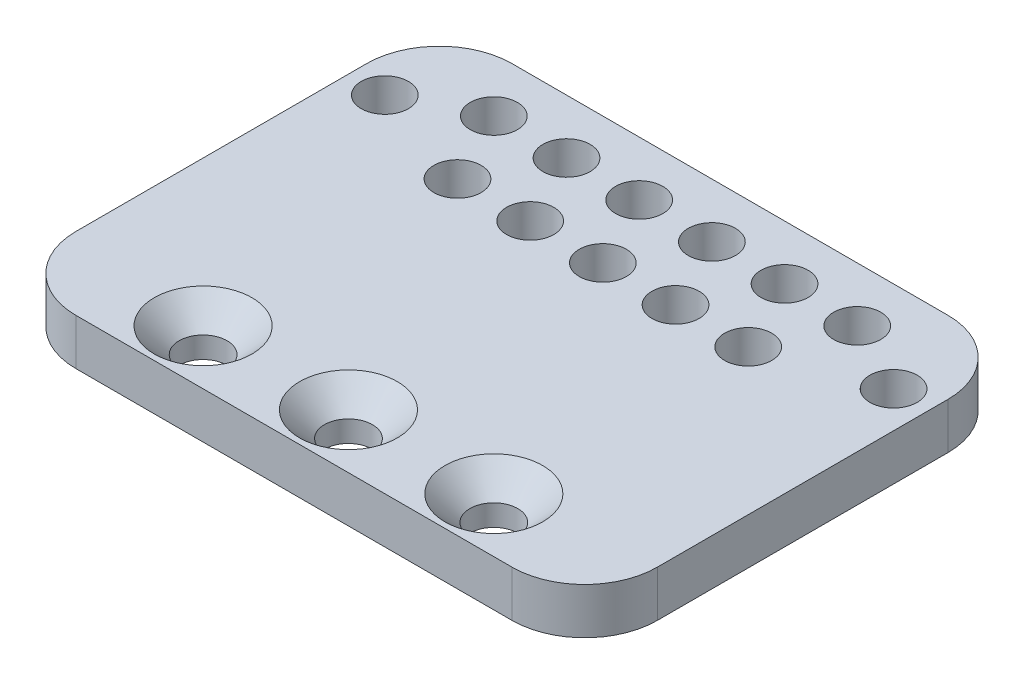
ISO-10303-21;
HEADER;
FILE_DESCRIPTION(('STEP AP214'),'2;1');
FILE_NAME('part.step','',(''),(''),'','','');
FILE_SCHEMA(('AUTOMOTIVE_DESIGN { 1 0 10303 214 1 1 1 1 }'));
ENDSEC;
DATA;
#1=APPLICATION_CONTEXT('core data for automotive mechanical design processes');
#2=APPLICATION_PROTOCOL_DEFINITION('international standard','automotive_design',2000,#1);
#3=PRODUCT_CONTEXT('',#1,'mechanical');
#4=PRODUCT('Part','Part','',(#3));
#5=PRODUCT_RELATED_PRODUCT_CATEGORY('part','',(#4));
#6=PRODUCT_DEFINITION_FORMATION('','',#4);
#7=PRODUCT_DEFINITION_CONTEXT('part definition',#1,'design');
#8=PRODUCT_DEFINITION('design','',#6,#7);
#9=PRODUCT_DEFINITION_SHAPE('','',#8);
#10=(LENGTH_UNIT() NAMED_UNIT(*) SI_UNIT(.MILLI.,.METRE.));
#11=(NAMED_UNIT(*) PLANE_ANGLE_UNIT() SI_UNIT($,.RADIAN.));
#12=(NAMED_UNIT(*) SI_UNIT($,.STERADIAN.) SOLID_ANGLE_UNIT());
#13=UNCERTAINTY_MEASURE_WITH_UNIT(LENGTH_MEASURE(1.E-05),#10,'distance_accuracy_value','');
#14=(GEOMETRIC_REPRESENTATION_CONTEXT(3) GLOBAL_UNCERTAINTY_ASSIGNED_CONTEXT((#13)) GLOBAL_UNIT_ASSIGNED_CONTEXT((#10,
#11,#12)) REPRESENTATION_CONTEXT('',''));
#15=CARTESIAN_POINT('',(0.,0.,0.));
#16=DIRECTION('',(0.,0.,1.));
#17=DIRECTION('',(1.,0.,0.));
#18=AXIS2_PLACEMENT_3D('',#15,#16,#17);
#19=CARTESIAN_POINT('',(0.,6.35,0.));
#20=DIRECTION('',(0.,0.,-1.));
#21=DIRECTION('',(-1.,0.,0.));
#22=AXIS2_PLACEMENT_3D('',#19,#20,#21);
#23=PLANE('',#22);
#24=DIRECTION('',(1.,0.,0.));
#25=VECTOR('',#24,1.);
#26=CARTESIAN_POINT('',(0.,0.,0.));
#27=LINE('',#26,#25);
#28=CARTESIAN_POINT('',(10.,0.,0.));
#29=VERTEX_POINT('',#28);
#30=CARTESIAN_POINT('',(70.,0.,0.));
#31=VERTEX_POINT('',#30);
#32=EDGE_CURVE('E111',#29,#31,#27,.T.);
#33=ORIENTED_EDGE('',*,*,#32,.T.);
#34=DIRECTION('',(0.,-1.,0.));
#35=VECTOR('',#34,1.);
#36=CARTESIAN_POINT('',(70.,6.35,0.));
#37=LINE('',#36,#35);
#38=CARTESIAN_POINT('',(70.,6.35,0.));
#39=VERTEX_POINT('',#38);
#40=EDGE_CURVE('E11',#31,#39,#37,.F.);
#41=ORIENTED_EDGE('',*,*,#40,.T.);
#42=DIRECTION('',(1.,0.,0.));
#43=VECTOR('',#42,1.);
#44=CARTESIAN_POINT('',(0.,6.35,0.));
#45=LINE('',#44,#43);
#46=CARTESIAN_POINT('',(10.,6.35,0.));
#47=VERTEX_POINT('',#46);
#48=EDGE_CURVE('E177',#47,#39,#45,.T.);
#49=ORIENTED_EDGE('',*,*,#48,.F.);
#50=DIRECTION('',(0.,-1.,0.));
#51=VECTOR('',#50,1.);
#52=CARTESIAN_POINT('',(10.,0.,0.));
#53=LINE('',#52,#51);
#54=EDGE_CURVE('E48',#47,#29,#53,.T.);
#55=ORIENTED_EDGE('',*,*,#54,.T.);
#56=EDGE_LOOP('',(#33,#41,#49,#55));
#57=FACE_BOUND('',#56,.T.);
#58=ADVANCED_FACE('F39',(#57),#23,.F.);
#59=CARTESIAN_POINT('',(80.,6.35,0.));
#60=DIRECTION('',(-1.,0.,0.));
#61=DIRECTION('',(0.,0.,1.));
#62=AXIS2_PLACEMENT_3D('',#59,#60,#61);
#63=PLANE('',#62);
#64=DIRECTION('',(0.,0.,-1.));
#65=VECTOR('',#64,1.);
#66=CARTESIAN_POINT('',(80.,0.,0.));
#67=LINE('',#66,#65);
#68=CARTESIAN_POINT('',(80.,0.,-10.));
#69=VERTEX_POINT('',#68);
#70=CARTESIAN_POINT('',(80.,0.,-50.));
#71=VERTEX_POINT('',#70);
#72=EDGE_CURVE('E248',#69,#71,#67,.T.);
#73=ORIENTED_EDGE('',*,*,#72,.T.);
#74=DIRECTION('',(0.,-1.,0.));
#75=VECTOR('',#74,1.);
#76=CARTESIAN_POINT('',(80.,6.35,-50.));
#77=LINE('',#76,#75);
#78=CARTESIAN_POINT('',(80.,6.35,-50.));
#79=VERTEX_POINT('',#78);
#80=EDGE_CURVE('E55',#71,#79,#77,.F.);
#81=ORIENTED_EDGE('',*,*,#80,.T.);
#82=DIRECTION('',(0.,0.,-1.));
#83=VECTOR('',#82,1.);
#84=CARTESIAN_POINT('',(80.,6.35,0.));
#85=LINE('',#84,#83);
#86=CARTESIAN_POINT('',(80.,6.35,-10.));
#87=VERTEX_POINT('',#86);
#88=EDGE_CURVE('E179',#87,#79,#85,.T.);
#89=ORIENTED_EDGE('',*,*,#88,.F.);
#90=DIRECTION('',(0.,-1.,0.));
#91=VECTOR('',#90,1.);
#92=CARTESIAN_POINT('',(80.,6.35,-10.));
#93=LINE('',#92,#91);
#94=EDGE_CURVE('E168',#87,#69,#93,.T.);
#95=ORIENTED_EDGE('',*,*,#94,.T.);
#96=EDGE_LOOP('',(#73,#81,#89,#95));
#97=FACE_BOUND('',#96,.T.);
#98=ADVANCED_FACE('F276',(#97),#63,.F.);
#99=CARTESIAN_POINT('',(0.,6.35,-60.));
#100=DIRECTION('',(0.,0.,-1.));
#101=DIRECTION('',(-1.,0.,0.));
#102=AXIS2_PLACEMENT_3D('',#99,#100,#101);
#103=PLANE('',#102);
#104=DIRECTION('',(1.,0.,0.));
#105=VECTOR('',#104,1.);
#106=CARTESIAN_POINT('',(0.,0.,-60.));
#107=LINE('',#106,#105);
#108=CARTESIAN_POINT('',(10.,0.,-60.));
#109=VERTEX_POINT('',#108);
#110=CARTESIAN_POINT('',(70.,0.,-60.));
#111=VERTEX_POINT('',#110);
#112=EDGE_CURVE('E129',#109,#111,#107,.T.);
#113=ORIENTED_EDGE('',*,*,#112,.F.);
#114=DIRECTION('',(0.,-1.,0.));
#115=VECTOR('',#114,1.);
#116=CARTESIAN_POINT('',(10.,6.35,-60.));
#117=LINE('',#116,#115);
#118=CARTESIAN_POINT('',(10.,6.35,-60.));
#119=VERTEX_POINT('',#118);
#120=EDGE_CURVE('E155',#109,#119,#117,.F.);
#121=ORIENTED_EDGE('',*,*,#120,.T.);
#122=DIRECTION('',(1.,0.,0.));
#123=VECTOR('',#122,1.);
#124=CARTESIAN_POINT('',(0.,6.35,-60.));
#125=LINE('',#124,#123);
#126=CARTESIAN_POINT('',(70.,6.35,-60.));
#127=VERTEX_POINT('',#126);
#128=EDGE_CURVE('E139',#119,#127,#125,.T.);
#129=ORIENTED_EDGE('',*,*,#128,.T.);
#130=DIRECTION('',(0.,-1.,0.));
#131=VECTOR('',#130,1.);
#132=CARTESIAN_POINT('',(70.,0.,-60.));
#133=LINE('',#132,#131);
#134=EDGE_CURVE('E151',#127,#111,#133,.T.);
#135=ORIENTED_EDGE('',*,*,#134,.T.);
#136=EDGE_LOOP('',(#113,#121,#129,#135));
#137=FACE_BOUND('',#136,.T.);
#138=ADVANCED_FACE('F256',(#137),#103,.T.);
#139=CARTESIAN_POINT('',(35.,6.35,-52.5));
#140=DIRECTION('',(0.,-1.,0.));
#141=DIRECTION('',(0.,0.,-1.));
#142=AXIS2_PLACEMENT_3D('',#139,#140,#141);
#143=CYLINDRICAL_SURFACE('',#142,3.25);
#144=CARTESIAN_POINT('',(35.,6.35,-52.5));
#145=DIRECTION('',(0.,1.,0.));
#146=DIRECTION('',(0.,0.,1.));
#147=AXIS2_PLACEMENT_3D('',#144,#145,#146);
#148=CIRCLE('',#147,3.25);
#149=CARTESIAN_POINT('',(35.,6.35,-49.25));
#150=VERTEX_POINT('',#149);
#151=EDGE_CURVE('E180',#150,#150,#148,.T.);
#152=ORIENTED_EDGE('',*,*,#151,.T.);
#153=EDGE_LOOP('',(#152));
#154=FACE_BOUND('',#153,.T.);
#155=CARTESIAN_POINT('',(35.,0.,-52.5));
#156=DIRECTION('',(0.,1.,0.));
#157=DIRECTION('',(0.,0.,1.));
#158=AXIS2_PLACEMENT_3D('',#155,#156,#157);
#159=CIRCLE('',#158,3.25);
#160=CARTESIAN_POINT('',(35.,0.,-49.25));
#161=VERTEX_POINT('',#160);
#162=EDGE_CURVE('E242',#161,#161,#159,.T.);
#163=ORIENTED_EDGE('',*,*,#162,.F.);
#164=EDGE_LOOP('',(#163));
#165=FACE_BOUND('',#164,.T.);
#166=ADVANCED_FACE('F284',(#154,#165),#143,.F.);
#167=CARTESIAN_POINT('',(45.,6.35,-52.5));
#168=DIRECTION('',(0.,-1.,0.));
#169=DIRECTION('',(0.,0.,-1.));
#170=AXIS2_PLACEMENT_3D('',#167,#168,#169);
#171=CYLINDRICAL_SURFACE('',#170,3.25);
#172=CARTESIAN_POINT('',(45.,6.35,-52.5));
#173=DIRECTION('',(0.,1.,0.));
#174=DIRECTION('',(0.,0.,1.));
#175=AXIS2_PLACEMENT_3D('',#172,#173,#174);
#176=CIRCLE('',#175,3.25);
#177=CARTESIAN_POINT('',(45.,6.35,-49.25));
#178=VERTEX_POINT('',#177);
#179=EDGE_CURVE('E186',#178,#178,#176,.T.);
#180=ORIENTED_EDGE('',*,*,#179,.T.);
#181=EDGE_LOOP('',(#180));
#182=FACE_BOUND('',#181,.T.);
#183=CARTESIAN_POINT('',(45.,0.,-52.5));
#184=DIRECTION('',(0.,1.,0.));
#185=DIRECTION('',(0.,0.,1.));
#186=AXIS2_PLACEMENT_3D('',#183,#184,#185);
#187=CIRCLE('',#186,3.25);
#188=CARTESIAN_POINT('',(45.,0.,-49.25));
#189=VERTEX_POINT('',#188);
#190=EDGE_CURVE('E238',#189,#189,#187,.T.);
#191=ORIENTED_EDGE('',*,*,#190,.F.);
#192=EDGE_LOOP('',(#191));
#193=FACE_BOUND('',#192,.T.);
#194=ADVANCED_FACE('F287',(#182,#193),#171,.F.);
#195=CARTESIAN_POINT('',(25.,6.35,-52.5));
#196=DIRECTION('',(0.,-1.,0.));
#197=DIRECTION('',(0.,0.,-1.));
#198=AXIS2_PLACEMENT_3D('',#195,#196,#197);
#199=CYLINDRICAL_SURFACE('',#198,3.25);
#200=CARTESIAN_POINT('',(25.,6.35,-52.5));
#201=DIRECTION('',(0.,1.,0.));
#202=DIRECTION('',(0.,0.,1.));
#203=AXIS2_PLACEMENT_3D('',#200,#201,#202);
#204=CIRCLE('',#203,3.25);
#205=CARTESIAN_POINT('',(25.,6.35,-49.25));
#206=VERTEX_POINT('',#205);
#207=EDGE_CURVE('E655',#206,#206,#204,.T.);
#208=ORIENTED_EDGE('',*,*,#207,.T.);
#209=EDGE_LOOP('',(#208));
#210=FACE_BOUND('',#209,.T.);
#211=CARTESIAN_POINT('',(25.,0.,-52.5));
#212=DIRECTION('',(0.,1.,0.));
#213=DIRECTION('',(0.,0.,1.));
#214=AXIS2_PLACEMENT_3D('',#211,#212,#213);
#215=CIRCLE('',#214,3.25);
#216=CARTESIAN_POINT('',(25.,0.,-49.25));
#217=VERTEX_POINT('',#216);
#218=EDGE_CURVE('E234',#217,#217,#215,.T.);
#219=ORIENTED_EDGE('',*,*,#218,.F.);
#220=EDGE_LOOP('',(#219));
#221=FACE_BOUND('',#220,.T.);
#222=ADVANCED_FACE('F291',(#210,#221),#199,.F.);
#223=CARTESIAN_POINT('',(30.,6.35,-42.5));
#224=DIRECTION('',(0.,-1.,0.));
#225=DIRECTION('',(0.,0.,-1.));
#226=AXIS2_PLACEMENT_3D('',#223,#224,#225);
#227=CYLINDRICAL_SURFACE('',#226,3.25);
#228=CARTESIAN_POINT('',(30.,6.35,-42.5));
#229=DIRECTION('',(0.,1.,0.));
#230=DIRECTION('',(0.,0.,1.));
#231=AXIS2_PLACEMENT_3D('',#228,#229,#230);
#232=CIRCLE('',#231,3.25);
#233=CARTESIAN_POINT('',(30.,6.35,-39.25));
#234=VERTEX_POINT('',#233);
#235=EDGE_CURVE('E651',#234,#234,#232,.T.);
#236=ORIENTED_EDGE('',*,*,#235,.T.);
#237=EDGE_LOOP('',(#236));
#238=FACE_BOUND('',#237,.T.);
#239=CARTESIAN_POINT('',(30.,0.,-42.5));
#240=DIRECTION('',(0.,1.,0.));
#241=DIRECTION('',(0.,0.,1.));
#242=AXIS2_PLACEMENT_3D('',#239,#240,#241);
#243=CIRCLE('',#242,3.25);
#244=CARTESIAN_POINT('',(30.,0.,-39.25));
#245=VERTEX_POINT('',#244);
#246=EDGE_CURVE('E230',#245,#245,#243,.T.);
#247=ORIENTED_EDGE('',*,*,#246,.F.);
#248=EDGE_LOOP('',(#247));
#249=FACE_BOUND('',#248,.T.);
#250=ADVANCED_FACE('F295',(#238,#249),#227,.F.);
#251=CARTESIAN_POINT('',(40.,6.35,-42.5));
#252=DIRECTION('',(0.,-1.,0.));
#253=DIRECTION('',(0.,0.,-1.));
#254=AXIS2_PLACEMENT_3D('',#251,#252,#253);
#255=CYLINDRICAL_SURFACE('',#254,3.25);
#256=CARTESIAN_POINT('',(40.,6.35,-42.5));
#257=DIRECTION('',(0.,1.,0.));
#258=DIRECTION('',(0.,0.,1.));
#259=AXIS2_PLACEMENT_3D('',#256,#257,#258);
#260=CIRCLE('',#259,3.25);
#261=CARTESIAN_POINT('',(40.,6.35,-39.25));
#262=VERTEX_POINT('',#261);
#263=EDGE_CURVE('E647',#262,#262,#260,.T.);
#264=ORIENTED_EDGE('',*,*,#263,.T.);
#265=EDGE_LOOP('',(#264));
#266=FACE_BOUND('',#265,.T.);
#267=CARTESIAN_POINT('',(40.,0.,-42.5));
#268=DIRECTION('',(0.,1.,0.));
#269=DIRECTION('',(0.,0.,1.));
#270=AXIS2_PLACEMENT_3D('',#267,#268,#269);
#271=CIRCLE('',#270,3.25);
#272=CARTESIAN_POINT('',(40.,0.,-39.25));
#273=VERTEX_POINT('',#272);
#274=EDGE_CURVE('E226',#273,#273,#271,.T.);
#275=ORIENTED_EDGE('',*,*,#274,.F.);
#276=EDGE_LOOP('',(#275));
#277=FACE_BOUND('',#276,.T.);
#278=ADVANCED_FACE('F299',(#266,#277),#255,.F.);
#279=CARTESIAN_POINT('',(50.,6.35,-42.5));
#280=DIRECTION('',(0.,-1.,0.));
#281=DIRECTION('',(0.,0.,-1.));
#282=AXIS2_PLACEMENT_3D('',#279,#280,#281);
#283=CYLINDRICAL_SURFACE('',#282,3.25);
#284=CARTESIAN_POINT('',(50.,6.35,-42.5));
#285=DIRECTION('',(0.,1.,0.));
#286=DIRECTION('',(0.,0.,1.));
#287=AXIS2_PLACEMENT_3D('',#284,#285,#286);
#288=CIRCLE('',#287,3.25);
#289=CARTESIAN_POINT('',(50.,6.35,-39.25));
#290=VERTEX_POINT('',#289);
#291=EDGE_CURVE('E643',#290,#290,#288,.T.);
#292=ORIENTED_EDGE('',*,*,#291,.T.);
#293=EDGE_LOOP('',(#292));
#294=FACE_BOUND('',#293,.T.);
#295=CARTESIAN_POINT('',(50.,0.,-42.5));
#296=DIRECTION('',(0.,1.,0.));
#297=DIRECTION('',(0.,0.,1.));
#298=AXIS2_PLACEMENT_3D('',#295,#296,#297);
#299=CIRCLE('',#298,3.25);
#300=CARTESIAN_POINT('',(50.,0.,-39.25));
#301=VERTEX_POINT('',#300);
#302=EDGE_CURVE('E222',#301,#301,#299,.T.);
#303=ORIENTED_EDGE('',*,*,#302,.F.);
#304=EDGE_LOOP('',(#303));
#305=FACE_BOUND('',#304,.T.);
#306=ADVANCED_FACE('F303',(#294,#305),#283,.F.);
#307=CARTESIAN_POINT('',(20.,6.35,-42.5));
#308=DIRECTION('',(0.,-1.,0.));
#309=DIRECTION('',(0.,0.,-1.));
#310=AXIS2_PLACEMENT_3D('',#307,#308,#309);
#311=CYLINDRICAL_SURFACE('',#310,3.25);
#312=CARTESIAN_POINT('',(20.,6.35,-42.5));
#313=DIRECTION('',(0.,1.,0.));
#314=DIRECTION('',(0.,0.,1.));
#315=AXIS2_PLACEMENT_3D('',#312,#313,#314);
#316=CIRCLE('',#315,3.25);
#317=CARTESIAN_POINT('',(20.,6.35,-39.25));
#318=VERTEX_POINT('',#317);
#319=EDGE_CURVE('E639',#318,#318,#316,.T.);
#320=ORIENTED_EDGE('',*,*,#319,.T.);
#321=EDGE_LOOP('',(#320));
#322=FACE_BOUND('',#321,.T.);
#323=CARTESIAN_POINT('',(20.,0.,-42.5));
#324=DIRECTION('',(0.,1.,0.));
#325=DIRECTION('',(0.,0.,1.));
#326=AXIS2_PLACEMENT_3D('',#323,#324,#325);
#327=CIRCLE('',#326,3.25);
#328=CARTESIAN_POINT('',(20.,0.,-39.25));
#329=VERTEX_POINT('',#328);
#330=EDGE_CURVE('E218',#329,#329,#327,.T.);
#331=ORIENTED_EDGE('',*,*,#330,.F.);
#332=EDGE_LOOP('',(#331));
#333=FACE_BOUND('',#332,.T.);
#334=ADVANCED_FACE('F307',(#322,#333),#311,.F.);
#335=CARTESIAN_POINT('',(15.,6.35,-52.5));
#336=DIRECTION('',(0.,-1.,0.));
#337=DIRECTION('',(0.,0.,-1.));
#338=AXIS2_PLACEMENT_3D('',#335,#336,#337);
#339=CYLINDRICAL_SURFACE('',#338,3.25000000000001);
#340=CARTESIAN_POINT('',(15.,6.35,-52.5));
#341=DIRECTION('',(0.,1.,0.));
#342=DIRECTION('',(0.,0.,1.));
#343=AXIS2_PLACEMENT_3D('',#340,#341,#342);
#344=CIRCLE('',#343,3.25000000000001);
#345=CARTESIAN_POINT('',(15.,6.35,-49.25));
#346=VERTEX_POINT('',#345);
#347=EDGE_CURVE('E635',#346,#346,#344,.T.);
#348=ORIENTED_EDGE('',*,*,#347,.T.);
#349=EDGE_LOOP('',(#348));
#350=FACE_BOUND('',#349,.T.);
#351=CARTESIAN_POINT('',(15.,0.,-52.5));
#352=DIRECTION('',(0.,1.,0.));
#353=DIRECTION('',(0.,0.,1.));
#354=AXIS2_PLACEMENT_3D('',#351,#352,#353);
#355=CIRCLE('',#354,3.25000000000001);
#356=CARTESIAN_POINT('',(15.,0.,-49.25));
#357=VERTEX_POINT('',#356);
#358=EDGE_CURVE('E214',#357,#357,#355,.T.);
#359=ORIENTED_EDGE('',*,*,#358,.F.);
#360=EDGE_LOOP('',(#359));
#361=FACE_BOUND('',#360,.T.);
#362=ADVANCED_FACE('F311',(#350,#361),#339,.F.);
#363=CARTESIAN_POINT('',(55.,6.35,-52.5));
#364=DIRECTION('',(0.,-1.,0.));
#365=DIRECTION('',(0.,0.,-1.));
#366=AXIS2_PLACEMENT_3D('',#363,#364,#365);
#367=CYLINDRICAL_SURFACE('',#366,3.25000000000001);
#368=CARTESIAN_POINT('',(55.,6.35,-52.5));
#369=DIRECTION('',(0.,1.,0.));
#370=DIRECTION('',(0.,0.,1.));
#371=AXIS2_PLACEMENT_3D('',#368,#369,#370);
#372=CIRCLE('',#371,3.25000000000001);
#373=CARTESIAN_POINT('',(55.,6.35,-49.25));
#374=VERTEX_POINT('',#373);
#375=EDGE_CURVE('E631',#374,#374,#372,.T.);
#376=ORIENTED_EDGE('',*,*,#375,.T.);
#377=EDGE_LOOP('',(#376));
#378=FACE_BOUND('',#377,.T.);
#379=CARTESIAN_POINT('',(55.,0.,-52.5));
#380=DIRECTION('',(0.,1.,0.));
#381=DIRECTION('',(0.,0.,1.));
#382=AXIS2_PLACEMENT_3D('',#379,#380,#381);
#383=CIRCLE('',#382,3.25000000000001);
#384=CARTESIAN_POINT('',(55.,0.,-49.25));
#385=VERTEX_POINT('',#384);
#386=EDGE_CURVE('E210',#385,#385,#383,.T.);
#387=ORIENTED_EDGE('',*,*,#386,.F.);
#388=EDGE_LOOP('',(#387));
#389=FACE_BOUND('',#388,.T.);
#390=ADVANCED_FACE('F315',(#378,#389),#367,.F.);
#391=CARTESIAN_POINT('',(65.,6.35,-52.5));
#392=DIRECTION('',(0.,-1.,0.));
#393=DIRECTION('',(0.,0.,-1.));
#394=AXIS2_PLACEMENT_3D('',#391,#392,#393);
#395=CYLINDRICAL_SURFACE('',#394,3.25000000000001);
#396=CARTESIAN_POINT('',(65.,6.35,-52.5));
#397=DIRECTION('',(0.,1.,0.));
#398=DIRECTION('',(0.,0.,1.));
#399=AXIS2_PLACEMENT_3D('',#396,#397,#398);
#400=CIRCLE('',#399,3.25000000000001);
#401=CARTESIAN_POINT('',(65.,6.35,-49.25));
#402=VERTEX_POINT('',#401);
#403=EDGE_CURVE('E627',#402,#402,#400,.T.);
#404=ORIENTED_EDGE('',*,*,#403,.T.);
#405=EDGE_LOOP('',(#404));
#406=FACE_BOUND('',#405,.T.);
#407=CARTESIAN_POINT('',(65.,0.,-52.5));
#408=DIRECTION('',(0.,1.,0.));
#409=DIRECTION('',(0.,0.,1.));
#410=AXIS2_PLACEMENT_3D('',#407,#408,#409);
#411=CIRCLE('',#410,3.25000000000001);
#412=CARTESIAN_POINT('',(65.,0.,-49.25));
#413=VERTEX_POINT('',#412);
#414=EDGE_CURVE('E206',#413,#413,#411,.T.);
#415=ORIENTED_EDGE('',*,*,#414,.F.);
#416=EDGE_LOOP('',(#415));
#417=FACE_BOUND('',#416,.T.);
#418=ADVANCED_FACE('F319',(#406,#417),#395,.F.);
#419=CARTESIAN_POINT('',(60.,6.35,-42.5));
#420=DIRECTION('',(0.,-1.,0.));
#421=DIRECTION('',(0.,0.,-1.));
#422=AXIS2_PLACEMENT_3D('',#419,#420,#421);
#423=CYLINDRICAL_SURFACE('',#422,3.25000000000001);
#424=CARTESIAN_POINT('',(60.,6.35,-42.5));
#425=DIRECTION('',(0.,1.,0.));
#426=DIRECTION('',(0.,0.,1.));
#427=AXIS2_PLACEMENT_3D('',#424,#425,#426);
#428=CIRCLE('',#427,3.25000000000001);
#429=CARTESIAN_POINT('',(60.,6.35,-39.25));
#430=VERTEX_POINT('',#429);
#431=EDGE_CURVE('E623',#430,#430,#428,.T.);
#432=ORIENTED_EDGE('',*,*,#431,.T.);
#433=EDGE_LOOP('',(#432));
#434=FACE_BOUND('',#433,.T.);
#435=CARTESIAN_POINT('',(60.,0.,-42.5));
#436=DIRECTION('',(0.,1.,0.));
#437=DIRECTION('',(0.,0.,1.));
#438=AXIS2_PLACEMENT_3D('',#435,#436,#437);
#439=CIRCLE('',#438,3.25000000000001);
#440=CARTESIAN_POINT('',(60.,0.,-39.25));
#441=VERTEX_POINT('',#440);
#442=EDGE_CURVE('E202',#441,#441,#439,.T.);
#443=ORIENTED_EDGE('',*,*,#442,.F.);
#444=EDGE_LOOP('',(#443));
#445=FACE_BOUND('',#444,.T.);
#446=ADVANCED_FACE('F323',(#434,#445),#423,.F.);
#447=CARTESIAN_POINT('',(75.,6.35,-47.5));
#448=DIRECTION('',(0.,-1.,0.));
#449=DIRECTION('',(0.,0.,-1.));
#450=AXIS2_PLACEMENT_3D('',#447,#448,#449);
#451=CYLINDRICAL_SURFACE('',#450,3.25000000000001);
#452=CARTESIAN_POINT('',(75.,6.35,-47.5));
#453=DIRECTION('',(0.,1.,0.));
#454=DIRECTION('',(0.,0.,1.));
#455=AXIS2_PLACEMENT_3D('',#452,#453,#454);
#456=CIRCLE('',#455,3.25000000000001);
#457=CARTESIAN_POINT('',(75.,6.35,-44.25));
#458=VERTEX_POINT('',#457);
#459=EDGE_CURVE('E619',#458,#458,#456,.T.);
#460=ORIENTED_EDGE('',*,*,#459,.T.);
#461=EDGE_LOOP('',(#460));
#462=FACE_BOUND('',#461,.T.);
#463=CARTESIAN_POINT('',(75.,0.,-47.5));
#464=DIRECTION('',(0.,1.,0.));
#465=DIRECTION('',(0.,0.,1.));
#466=AXIS2_PLACEMENT_3D('',#463,#464,#465);
#467=CIRCLE('',#466,3.25000000000001);
#468=CARTESIAN_POINT('',(75.,0.,-44.25));
#469=VERTEX_POINT('',#468);
#470=EDGE_CURVE('E197',#469,#469,#467,.T.);
#471=ORIENTED_EDGE('',*,*,#470,.F.);
#472=EDGE_LOOP('',(#471));
#473=FACE_BOUND('',#472,.T.);
#474=ADVANCED_FACE('F327',(#462,#473),#451,.F.);
#475=CARTESIAN_POINT('',(5.,6.35,-47.5));
#476=DIRECTION('',(0.,-1.,0.));
#477=DIRECTION('',(0.,0.,-1.));
#478=AXIS2_PLACEMENT_3D('',#475,#476,#477);
#479=CYLINDRICAL_SURFACE('',#478,3.25);
#480=CARTESIAN_POINT('',(5.,6.35,-47.5));
#481=DIRECTION('',(0.,1.,0.));
#482=DIRECTION('',(0.,0.,1.));
#483=AXIS2_PLACEMENT_3D('',#480,#481,#482);
#484=CIRCLE('',#483,3.25);
#485=CARTESIAN_POINT('',(5.,6.35,-44.25));
#486=VERTEX_POINT('',#485);
#487=EDGE_CURVE('E128',#486,#486,#484,.T.);
#488=ORIENTED_EDGE('',*,*,#487,.T.);
#489=EDGE_LOOP('',(#488));
#490=FACE_BOUND('',#489,.T.);
#491=CARTESIAN_POINT('',(5.,0.,-47.5));
#492=DIRECTION('',(0.,1.,0.));
#493=DIRECTION('',(0.,0.,1.));
#494=AXIS2_PLACEMENT_3D('',#491,#492,#493);
#495=CIRCLE('',#494,3.25);
#496=CARTESIAN_POINT('',(5.,0.,-44.25));
#497=VERTEX_POINT('',#496);
#498=EDGE_CURVE('E193',#497,#497,#495,.T.);
#499=ORIENTED_EDGE('',*,*,#498,.F.);
#500=EDGE_LOOP('',(#499));
#501=FACE_BOUND('',#500,.T.);
#502=ADVANCED_FACE('F331',(#490,#501),#479,.F.);
#503=CARTESIAN_POINT('',(0.,6.35,0.));
#504=DIRECTION('',(-1.,0.,0.));
#505=DIRECTION('',(0.,0.,1.));
#506=AXIS2_PLACEMENT_3D('',#503,#504,#505);
#507=PLANE('',#506);
#508=DIRECTION('',(0.,0.,-1.));
#509=VECTOR('',#508,1.);
#510=CARTESIAN_POINT('',(0.,6.35,0.));
#511=LINE('',#510,#509);
#512=CARTESIAN_POINT('',(0.,6.35,-10.));
#513=VERTEX_POINT('',#512);
#514=CARTESIAN_POINT('',(0.,6.35,-50.));
#515=VERTEX_POINT('',#514);
#516=EDGE_CURVE('E134',#513,#515,#511,.T.);
#517=ORIENTED_EDGE('',*,*,#516,.T.);
#518=DIRECTION('',(0.,-1.,0.));
#519=VECTOR('',#518,1.);
#520=CARTESIAN_POINT('',(0.,6.35,-50.));
#521=LINE('',#520,#519);
#522=CARTESIAN_POINT('',(0.,0.,-50.));
#523=VERTEX_POINT('',#522);
#524=EDGE_CURVE('E118',#515,#523,#521,.T.);
#525=ORIENTED_EDGE('',*,*,#524,.T.);
#526=DIRECTION('',(0.,0.,-1.));
#527=VECTOR('',#526,1.);
#528=CARTESIAN_POINT('',(0.,0.,0.));
#529=LINE('',#528,#527);
#530=CARTESIAN_POINT('',(0.,0.,-10.));
#531=VERTEX_POINT('',#530);
#532=EDGE_CURVE('E109',#531,#523,#529,.T.);
#533=ORIENTED_EDGE('',*,*,#532,.F.);
#534=DIRECTION('',(0.,-1.,0.));
#535=VECTOR('',#534,1.);
#536=CARTESIAN_POINT('',(0.,6.35,-10.));
#537=LINE('',#536,#535);
#538=EDGE_CURVE('E124',#531,#513,#537,.F.);
#539=ORIENTED_EDGE('',*,*,#538,.T.);
#540=EDGE_LOOP('',(#517,#525,#533,#539));
#541=FACE_BOUND('',#540,.T.);
#542=ADVANCED_FACE('F123',(#541),#507,.T.);
#543=CARTESIAN_POINT('',(0.,6.35,0.));
#544=DIRECTION('',(0.,1.,0.));
#545=DIRECTION('',(0.,0.,1.));
#546=AXIS2_PLACEMENT_3D('',#543,#544,#545);
#547=PLANE('',#546);
#548=CARTESIAN_POINT('',(20.,6.35,-7.5));
#549=DIRECTION('',(0.,1.,0.));
#550=DIRECTION('',(0.,0.,1.));
#551=AXIS2_PLACEMENT_3D('',#548,#549,#550);
#552=CIRCLE('',#551,6.72);
#553=CARTESIAN_POINT('',(20.,6.35,-0.779999999999999));
#554=VERTEX_POINT('',#553);
#555=EDGE_CURVE('E585',#554,#554,#552,.T.);
#556=ORIENTED_EDGE('',*,*,#555,.F.);
#557=EDGE_LOOP('',(#556));
#558=FACE_BOUND('',#557,.T.);
#559=CARTESIAN_POINT('',(40.,6.35,-7.5));
#560=DIRECTION('',(0.,1.,0.));
#561=DIRECTION('',(0.,0.,1.));
#562=AXIS2_PLACEMENT_3D('',#559,#560,#561);
#563=CIRCLE('',#562,6.72);
#564=CARTESIAN_POINT('',(40.,6.35,-0.779999999999996));
#565=VERTEX_POINT('',#564);
#566=EDGE_CURVE('E594',#565,#565,#563,.T.);
#567=ORIENTED_EDGE('',*,*,#566,.F.);
#568=EDGE_LOOP('',(#567));
#569=FACE_BOUND('',#568,.T.);
#570=CARTESIAN_POINT('',(60.,6.35,-7.5));
#571=DIRECTION('',(0.,1.,0.));
#572=DIRECTION('',(0.,0.,1.));
#573=AXIS2_PLACEMENT_3D('',#570,#571,#572);
#574=CIRCLE('',#573,6.72);
#575=CARTESIAN_POINT('',(60.,6.35,-0.779999999999996));
#576=VERTEX_POINT('',#575);
#577=EDGE_CURVE('E606',#576,#576,#574,.T.);
#578=ORIENTED_EDGE('',*,*,#577,.F.);
#579=EDGE_LOOP('',(#578));
#580=FACE_BOUND('',#579,.T.);
#581=ORIENTED_EDGE('',*,*,#487,.F.);
#582=EDGE_LOOP('',(#581));
#583=FACE_BOUND('',#582,.T.);
#584=ORIENTED_EDGE('',*,*,#459,.F.);
#585=EDGE_LOOP('',(#584));
#586=FACE_BOUND('',#585,.T.);
#587=ORIENTED_EDGE('',*,*,#431,.F.);
#588=EDGE_LOOP('',(#587));
#589=FACE_BOUND('',#588,.T.);
#590=ORIENTED_EDGE('',*,*,#403,.F.);
#591=EDGE_LOOP('',(#590));
#592=FACE_BOUND('',#591,.T.);
#593=ORIENTED_EDGE('',*,*,#375,.F.);
#594=EDGE_LOOP('',(#593));
#595=FACE_BOUND('',#594,.T.);
#596=ORIENTED_EDGE('',*,*,#347,.F.);
#597=EDGE_LOOP('',(#596));
#598=FACE_BOUND('',#597,.T.);
#599=ORIENTED_EDGE('',*,*,#319,.F.);
#600=EDGE_LOOP('',(#599));
#601=FACE_BOUND('',#600,.T.);
#602=ORIENTED_EDGE('',*,*,#291,.F.);
#603=EDGE_LOOP('',(#602));
#604=FACE_BOUND('',#603,.T.);
#605=ORIENTED_EDGE('',*,*,#263,.F.);
#606=EDGE_LOOP('',(#605));
#607=FACE_BOUND('',#606,.T.);
#608=ORIENTED_EDGE('',*,*,#235,.F.);
#609=EDGE_LOOP('',(#608));
#610=FACE_BOUND('',#609,.T.);
#611=ORIENTED_EDGE('',*,*,#207,.F.);
#612=EDGE_LOOP('',(#611));
#613=FACE_BOUND('',#612,.T.);
#614=ORIENTED_EDGE('',*,*,#179,.F.);
#615=EDGE_LOOP('',(#614));
#616=FACE_BOUND('',#615,.T.);
#617=ORIENTED_EDGE('',*,*,#151,.F.);
#618=EDGE_LOOP('',(#617));
#619=FACE_BOUND('',#618,.T.);
#620=ORIENTED_EDGE('',*,*,#128,.F.);
#621=CARTESIAN_POINT('',(10.,6.35,-50.));
#622=DIRECTION('',(0.,1.,0.));
#623=DIRECTION('',(0.,0.,1.));
#624=AXIS2_PLACEMENT_3D('',#621,#622,#623);
#625=CIRCLE('',#624,10.);
#626=EDGE_CURVE('E165',#119,#515,#625,.T.);
#627=ORIENTED_EDGE('',*,*,#626,.T.);
#628=ORIENTED_EDGE('',*,*,#516,.F.);
#629=CARTESIAN_POINT('',(10.,6.35,-10.));
#630=DIRECTION('',(0.,1.,0.));
#631=DIRECTION('',(0.,0.,1.));
#632=AXIS2_PLACEMENT_3D('',#629,#630,#631);
#633=CIRCLE('',#632,10.);
#634=EDGE_CURVE('E132',#513,#47,#633,.T.);
#635=ORIENTED_EDGE('',*,*,#634,.T.);
#636=ORIENTED_EDGE('',*,*,#48,.T.);
#637=CARTESIAN_POINT('',(70.,6.35,-10.));
#638=DIRECTION('',(0.,1.,0.));
#639=DIRECTION('',(0.,0.,1.));
#640=AXIS2_PLACEMENT_3D('',#637,#638,#639);
#641=CIRCLE('',#640,10.);
#642=EDGE_CURVE('E62',#39,#87,#641,.T.);
#643=ORIENTED_EDGE('',*,*,#642,.T.);
#644=ORIENTED_EDGE('',*,*,#88,.T.);
#645=CARTESIAN_POINT('',(70.,6.35,-50.));
#646=DIRECTION('',(0.,1.,0.));
#647=DIRECTION('',(0.,0.,1.));
#648=AXIS2_PLACEMENT_3D('',#645,#646,#647);
#649=CIRCLE('',#648,10.);
#650=EDGE_CURVE('E162',#79,#127,#649,.T.);
#651=ORIENTED_EDGE('',*,*,#650,.T.);
#652=EDGE_LOOP('',(#620,#627,#628,#635,#636,#643,#644,#651));
#653=FACE_BOUND('',#652,.T.);
#654=ADVANCED_FACE('F262',(#558,#569,#580,#583,#586,#589,#592,#595,#598,#601,#604,#607,#610,
#613,#616,#619,#653),#547,.T.);
#655=CARTESIAN_POINT('',(0.,0.,0.));
#656=DIRECTION('',(0.,1.,0.));
#657=DIRECTION('',(0.,0.,1.));
#658=AXIS2_PLACEMENT_3D('',#655,#656,#657);
#659=PLANE('',#658);
#660=CARTESIAN_POINT('',(20.,0.,-7.5));
#661=DIRECTION('',(0.,1.,0.));
#662=DIRECTION('',(0.,0.,1.));
#663=AXIS2_PLACEMENT_3D('',#660,#661,#662);
#664=CIRCLE('',#663,3.3);
#665=CARTESIAN_POINT('',(20.,0.,-4.2));
#666=VERTEX_POINT('',#665);
#667=EDGE_CURVE('E589',#666,#666,#664,.T.);
#668=ORIENTED_EDGE('',*,*,#667,.T.);
#669=EDGE_LOOP('',(#668));
#670=FACE_BOUND('',#669,.T.);
#671=CARTESIAN_POINT('',(40.,0.,-7.5));
#672=DIRECTION('',(0.,1.,0.));
#673=DIRECTION('',(0.,0.,1.));
#674=AXIS2_PLACEMENT_3D('',#671,#672,#673);
#675=CIRCLE('',#674,3.3);
#676=CARTESIAN_POINT('',(40.,0.,-4.2));
#677=VERTEX_POINT('',#676);
#678=EDGE_CURVE('E602',#677,#677,#675,.T.);
#679=ORIENTED_EDGE('',*,*,#678,.T.);
#680=EDGE_LOOP('',(#679));
#681=FACE_BOUND('',#680,.T.);
#682=CARTESIAN_POINT('',(60.,0.,-7.5));
#683=DIRECTION('',(0.,1.,0.));
#684=DIRECTION('',(0.,0.,1.));
#685=AXIS2_PLACEMENT_3D('',#682,#683,#684);
#686=CIRCLE('',#685,3.3);
#687=CARTESIAN_POINT('',(60.,0.,-4.2));
#688=VERTEX_POINT('',#687);
#689=EDGE_CURVE('E198',#688,#688,#686,.T.);
#690=ORIENTED_EDGE('',*,*,#689,.T.);
#691=EDGE_LOOP('',(#690));
#692=FACE_BOUND('',#691,.T.);
#693=ORIENTED_EDGE('',*,*,#498,.T.);
#694=EDGE_LOOP('',(#693));
#695=FACE_BOUND('',#694,.T.);
#696=ORIENTED_EDGE('',*,*,#470,.T.);
#697=EDGE_LOOP('',(#696));
#698=FACE_BOUND('',#697,.T.);
#699=ORIENTED_EDGE('',*,*,#442,.T.);
#700=EDGE_LOOP('',(#699));
#701=FACE_BOUND('',#700,.T.);
#702=ORIENTED_EDGE('',*,*,#414,.T.);
#703=EDGE_LOOP('',(#702));
#704=FACE_BOUND('',#703,.T.);
#705=ORIENTED_EDGE('',*,*,#386,.T.);
#706=EDGE_LOOP('',(#705));
#707=FACE_BOUND('',#706,.T.);
#708=ORIENTED_EDGE('',*,*,#358,.T.);
#709=EDGE_LOOP('',(#708));
#710=FACE_BOUND('',#709,.T.);
#711=ORIENTED_EDGE('',*,*,#330,.T.);
#712=EDGE_LOOP('',(#711));
#713=FACE_BOUND('',#712,.T.);
#714=ORIENTED_EDGE('',*,*,#302,.T.);
#715=EDGE_LOOP('',(#714));
#716=FACE_BOUND('',#715,.T.);
#717=ORIENTED_EDGE('',*,*,#274,.T.);
#718=EDGE_LOOP('',(#717));
#719=FACE_BOUND('',#718,.T.);
#720=ORIENTED_EDGE('',*,*,#246,.T.);
#721=EDGE_LOOP('',(#720));
#722=FACE_BOUND('',#721,.T.);
#723=ORIENTED_EDGE('',*,*,#218,.T.);
#724=EDGE_LOOP('',(#723));
#725=FACE_BOUND('',#724,.T.);
#726=ORIENTED_EDGE('',*,*,#190,.T.);
#727=EDGE_LOOP('',(#726));
#728=FACE_BOUND('',#727,.T.);
#729=ORIENTED_EDGE('',*,*,#162,.T.);
#730=EDGE_LOOP('',(#729));
#731=FACE_BOUND('',#730,.T.);
#732=ORIENTED_EDGE('',*,*,#532,.T.);
#733=CARTESIAN_POINT('',(10.,0.,-50.));
#734=DIRECTION('',(0.,1.,0.));
#735=DIRECTION('',(0.,0.,1.));
#736=AXIS2_PLACEMENT_3D('',#733,#734,#735);
#737=CIRCLE('',#736,10.);
#738=EDGE_CURVE('E148',#523,#109,#737,.F.);
#739=ORIENTED_EDGE('',*,*,#738,.T.);
#740=ORIENTED_EDGE('',*,*,#112,.T.);
#741=CARTESIAN_POINT('',(70.,0.,-50.));
#742=DIRECTION('',(0.,1.,0.));
#743=DIRECTION('',(0.,0.,1.));
#744=AXIS2_PLACEMENT_3D('',#741,#742,#743);
#745=CIRCLE('',#744,10.);
#746=EDGE_CURVE('E145',#111,#71,#745,.F.);
#747=ORIENTED_EDGE('',*,*,#746,.T.);
#748=ORIENTED_EDGE('',*,*,#72,.F.);
#749=CARTESIAN_POINT('',(70.,0.,-10.));
#750=DIRECTION('',(0.,1.,0.));
#751=DIRECTION('',(0.,0.,1.));
#752=AXIS2_PLACEMENT_3D('',#749,#750,#751);
#753=CIRCLE('',#752,10.);
#754=EDGE_CURVE('E117',#69,#31,#753,.F.);
#755=ORIENTED_EDGE('',*,*,#754,.T.);
#756=ORIENTED_EDGE('',*,*,#32,.F.);
#757=CARTESIAN_POINT('',(10.,0.,-10.));
#758=DIRECTION('',(0.,1.,0.));
#759=DIRECTION('',(0.,0.,1.));
#760=AXIS2_PLACEMENT_3D('',#757,#758,#759);
#761=CIRCLE('',#760,10.);
#762=EDGE_CURVE('E106',#29,#531,#761,.F.);
#763=ORIENTED_EDGE('',*,*,#762,.T.);
#764=EDGE_LOOP('',(#732,#739,#740,#747,#748,#755,#756,#763));
#765=FACE_BOUND('',#764,.T.);
#766=ADVANCED_FACE('F108',(#670,#681,#692,#695,#698,#701,#704,#707,#710,#713,#716,#719,#722,
#725,#728,#731,#765),#659,.F.);
#767=CARTESIAN_POINT('',(10.,6.35,-50.));
#768=DIRECTION('',(0.,-1.,0.));
#769=DIRECTION('',(0.,0.,-1.));
#770=AXIS2_PLACEMENT_3D('',#767,#768,#769);
#771=CYLINDRICAL_SURFACE('',#770,10.);
#772=ORIENTED_EDGE('',*,*,#626,.F.);
#773=ORIENTED_EDGE('',*,*,#120,.F.);
#774=ORIENTED_EDGE('',*,*,#738,.F.);
#775=ORIENTED_EDGE('',*,*,#524,.F.);
#776=EDGE_LOOP('',(#772,#773,#774,#775));
#777=FACE_BOUND('',#776,.T.);
#778=ADVANCED_FACE('F261',(#777),#771,.T.);
#779=CARTESIAN_POINT('',(70.,6.35,-50.));
#780=DIRECTION('',(0.,1.,0.));
#781=DIRECTION('',(0.,0.,1.));
#782=AXIS2_PLACEMENT_3D('',#779,#780,#781);
#783=CYLINDRICAL_SURFACE('',#782,10.);
#784=ORIENTED_EDGE('',*,*,#650,.F.);
#785=ORIENTED_EDGE('',*,*,#80,.F.);
#786=ORIENTED_EDGE('',*,*,#746,.F.);
#787=ORIENTED_EDGE('',*,*,#134,.F.);
#788=EDGE_LOOP('',(#784,#785,#786,#787));
#789=FACE_BOUND('',#788,.T.);
#790=ADVANCED_FACE('F265',(#789),#783,.T.);
#791=CARTESIAN_POINT('',(70.,6.35,-10.));
#792=DIRECTION('',(0.,-1.,0.));
#793=DIRECTION('',(0.,0.,-1.));
#794=AXIS2_PLACEMENT_3D('',#791,#792,#793);
#795=CYLINDRICAL_SURFACE('',#794,10.);
#796=ORIENTED_EDGE('',*,*,#642,.F.);
#797=ORIENTED_EDGE('',*,*,#40,.F.);
#798=ORIENTED_EDGE('',*,*,#754,.F.);
#799=ORIENTED_EDGE('',*,*,#94,.F.);
#800=EDGE_LOOP('',(#796,#797,#798,#799));
#801=FACE_BOUND('',#800,.T.);
#802=ADVANCED_FACE('F267',(#801),#795,.T.);
#803=CARTESIAN_POINT('',(10.,6.35,-10.));
#804=DIRECTION('',(0.,1.,0.));
#805=DIRECTION('',(0.,0.,1.));
#806=AXIS2_PLACEMENT_3D('',#803,#804,#805);
#807=CYLINDRICAL_SURFACE('',#806,10.);
#808=ORIENTED_EDGE('',*,*,#634,.F.);
#809=ORIENTED_EDGE('',*,*,#538,.F.);
#810=ORIENTED_EDGE('',*,*,#762,.F.);
#811=ORIENTED_EDGE('',*,*,#54,.F.);
#812=EDGE_LOOP('',(#808,#809,#810,#811));
#813=FACE_BOUND('',#812,.T.);
#814=ADVANCED_FACE('F41',(#813),#807,.T.);
#815=CARTESIAN_POINT('',(60.,6.35,-7.5));
#816=DIRECTION('',(0.,1.,0.));
#817=DIRECTION('',(0.,0.,1.));
#818=AXIS2_PLACEMENT_3D('',#815,#816,#817);
#819=CYLINDRICAL_SURFACE('',#818,3.29999999999999);
#820=ORIENTED_EDGE('',*,*,#689,.F.);
#821=EDGE_LOOP('',(#820));
#822=FACE_BOUND('',#821,.T.);
#823=CARTESIAN_POINT('',(60.,2.92999999999998,-7.5));
#824=DIRECTION('',(0.,1.,0.));
#825=DIRECTION('',(0.,0.,1.));
#826=AXIS2_PLACEMENT_3D('',#823,#824,#825);
#827=CIRCLE('',#826,3.29999999999998);
#828=CARTESIAN_POINT('',(60.,2.92999999999998,-4.20000000000002));
#829=VERTEX_POINT('',#828);
#830=EDGE_CURVE('E610',#829,#829,#827,.T.);
#831=ORIENTED_EDGE('',*,*,#830,.T.);
#832=EDGE_LOOP('',(#831));
#833=FACE_BOUND('',#832,.T.);
#834=ADVANCED_FACE('F519',(#822,#833),#819,.F.);
#835=CARTESIAN_POINT('',(60.,6.35,-7.5));
#836=DIRECTION('',(0.,1.,0.));
#837=DIRECTION('',(0.,0.,1.));
#838=AXIS2_PLACEMENT_3D('',#835,#836,#837);
#839=CONICAL_SURFACE('',#838,6.72,0.785398163397448);
#840=ORIENTED_EDGE('',*,*,#830,.F.);
#841=EDGE_LOOP('',(#840));
#842=FACE_BOUND('',#841,.T.);
#843=ORIENTED_EDGE('',*,*,#577,.T.);
#844=EDGE_LOOP('',(#843));
#845=FACE_BOUND('',#844,.T.);
#846=ADVANCED_FACE('F525',(#842,#845),#839,.F.);
#847=CARTESIAN_POINT('',(40.,6.35,-7.5));
#848=DIRECTION('',(0.,1.,0.));
#849=DIRECTION('',(0.,0.,1.));
#850=AXIS2_PLACEMENT_3D('',#847,#848,#849);
#851=CYLINDRICAL_SURFACE('',#850,3.29999999999999);
#852=ORIENTED_EDGE('',*,*,#678,.F.);
#853=EDGE_LOOP('',(#852));
#854=FACE_BOUND('',#853,.T.);
#855=CARTESIAN_POINT('',(40.,2.92999999999998,-7.5));
#856=DIRECTION('',(0.,1.,0.));
#857=DIRECTION('',(0.,0.,1.));
#858=AXIS2_PLACEMENT_3D('',#855,#856,#857);
#859=CIRCLE('',#858,3.29999999999998);
#860=CARTESIAN_POINT('',(40.,2.92999999999998,-4.20000000000002));
#861=VERTEX_POINT('',#860);
#862=EDGE_CURVE('E598',#861,#861,#859,.T.);
#863=ORIENTED_EDGE('',*,*,#862,.T.);
#864=EDGE_LOOP('',(#863));
#865=FACE_BOUND('',#864,.T.);
#866=ADVANCED_FACE('F533',(#854,#865),#851,.F.);
#867=CARTESIAN_POINT('',(40.,6.35,-7.5));
#868=DIRECTION('',(0.,1.,0.));
#869=DIRECTION('',(0.,0.,1.));
#870=AXIS2_PLACEMENT_3D('',#867,#868,#869);
#871=CONICAL_SURFACE('',#870,6.72,0.785398163397448);
#872=ORIENTED_EDGE('',*,*,#862,.F.);
#873=EDGE_LOOP('',(#872));
#874=FACE_BOUND('',#873,.T.);
#875=ORIENTED_EDGE('',*,*,#566,.T.);
#876=EDGE_LOOP('',(#875));
#877=FACE_BOUND('',#876,.T.);
#878=ADVANCED_FACE('F542',(#874,#877),#871,.F.);
#879=CARTESIAN_POINT('',(20.,6.35,-7.5));
#880=DIRECTION('',(0.,1.,0.));
#881=DIRECTION('',(0.,0.,1.));
#882=AXIS2_PLACEMENT_3D('',#879,#880,#881);
#883=CYLINDRICAL_SURFACE('',#882,3.29999999999999);
#884=ORIENTED_EDGE('',*,*,#667,.F.);
#885=EDGE_LOOP('',(#884));
#886=FACE_BOUND('',#885,.T.);
#887=CARTESIAN_POINT('',(20.,2.92999999999998,-7.5));
#888=DIRECTION('',(0.,1.,0.));
#889=DIRECTION('',(0.,0.,1.));
#890=AXIS2_PLACEMENT_3D('',#887,#888,#889);
#891=CIRCLE('',#890,3.29999999999999);
#892=CARTESIAN_POINT('',(20.,2.92999999999998,-4.20000000000001));
#893=VERTEX_POINT('',#892);
#894=EDGE_CURVE('E582',#893,#893,#891,.T.);
#895=ORIENTED_EDGE('',*,*,#894,.T.);
#896=EDGE_LOOP('',(#895));
#897=FACE_BOUND('',#896,.T.);
#898=ADVANCED_FACE('F551',(#886,#897),#883,.F.);
#899=CARTESIAN_POINT('',(20.,6.35,-7.5));
#900=DIRECTION('',(0.,1.,0.));
#901=DIRECTION('',(0.,0.,1.));
#902=AXIS2_PLACEMENT_3D('',#899,#900,#901);
#903=CONICAL_SURFACE('',#902,6.72,0.785398163397447);
#904=ORIENTED_EDGE('',*,*,#894,.F.);
#905=EDGE_LOOP('',(#904));
#906=FACE_BOUND('',#905,.T.);
#907=ORIENTED_EDGE('',*,*,#555,.T.);
#908=EDGE_LOOP('',(#907));
#909=FACE_BOUND('',#908,.T.);
#910=ADVANCED_FACE('F560',(#906,#909),#903,.F.);
#911=CLOSED_SHELL('',(#58,#98,#138,#166,#194,#222,#250,#278,#306,#334,#362,#390,#418,#446,#474,
#502,#542,#654,#766,#778,#790,#802,#814,#834,#846,#866,#878,#898,#910));
#912=MANIFOLD_SOLID_BREP('B2',#911);
#913=ADVANCED_BREP_SHAPE_REPRESENTATION('',(#18,#912),#14);
#914=SHAPE_DEFINITION_REPRESENTATION(#9,#913);
ENDSEC;
END-ISO-10303-21;
